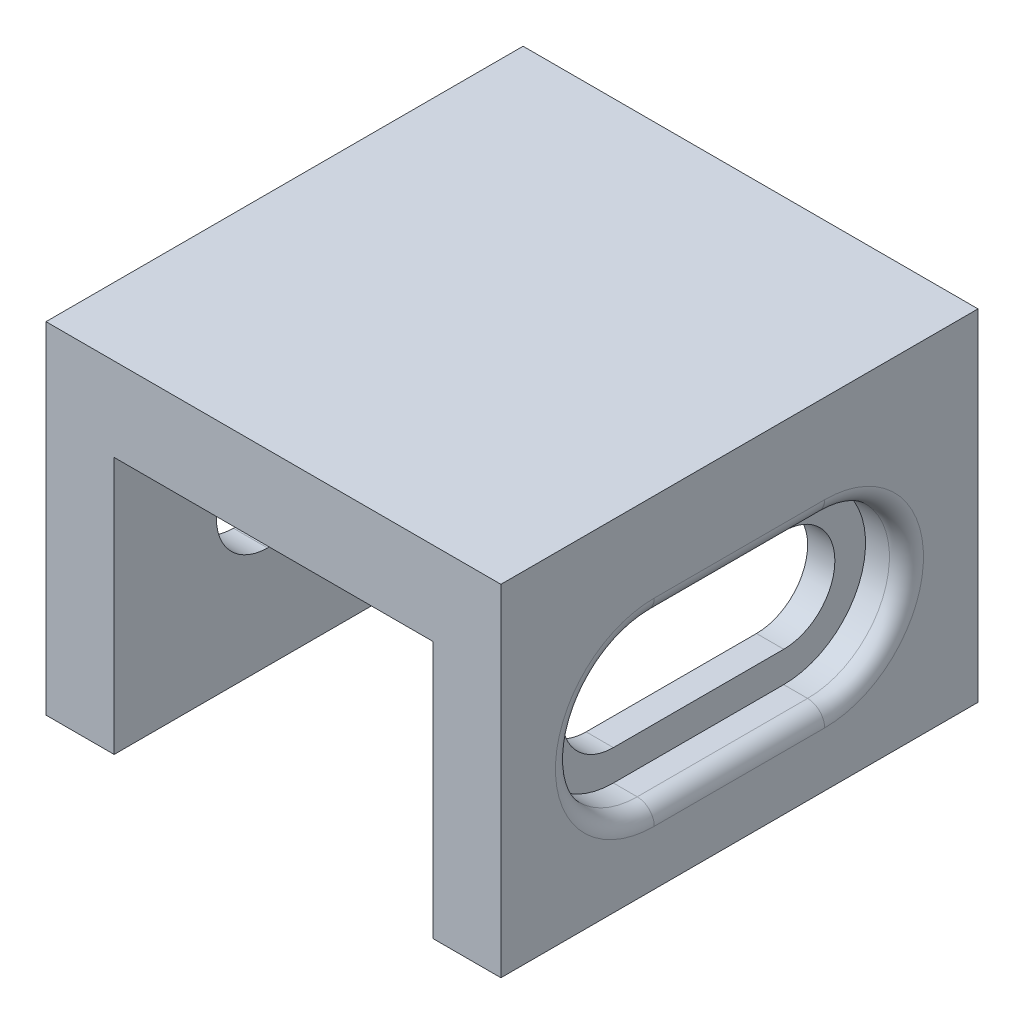
ISO-10303-21;
HEADER;
FILE_DESCRIPTION(('STEP AP214'),'2;1');
FILE_NAME('part.step','',(''),(''),'','','');
FILE_SCHEMA(('AUTOMOTIVE_DESIGN { 1 0 10303 214 1 1 1 1 }'));
ENDSEC;
DATA;
#1=APPLICATION_CONTEXT('core data for automotive mechanical design processes');
#2=APPLICATION_PROTOCOL_DEFINITION('international standard','automotive_design',2000,#1);
#3=PRODUCT_CONTEXT('',#1,'mechanical');
#4=PRODUCT('Part','Part','',(#3));
#5=PRODUCT_RELATED_PRODUCT_CATEGORY('part','',(#4));
#6=PRODUCT_DEFINITION_FORMATION('','',#4);
#7=PRODUCT_DEFINITION_CONTEXT('part definition',#1,'design');
#8=PRODUCT_DEFINITION('design','',#6,#7);
#9=PRODUCT_DEFINITION_SHAPE('','',#8);
#10=(LENGTH_UNIT() NAMED_UNIT(*) SI_UNIT(.MILLI.,.METRE.));
#11=(NAMED_UNIT(*) PLANE_ANGLE_UNIT() SI_UNIT($,.RADIAN.));
#12=(NAMED_UNIT(*) SI_UNIT($,.STERADIAN.) SOLID_ANGLE_UNIT());
#13=UNCERTAINTY_MEASURE_WITH_UNIT(LENGTH_MEASURE(1.E-05),#10,'distance_accuracy_value','');
#14=(GEOMETRIC_REPRESENTATION_CONTEXT(3) GLOBAL_UNCERTAINTY_ASSIGNED_CONTEXT((#13)) GLOBAL_UNIT_ASSIGNED_CONTEXT((#10,
#11,#12)) REPRESENTATION_CONTEXT('',''));
#15=CARTESIAN_POINT('',(0.,0.,0.));
#16=DIRECTION('',(0.,0.,1.));
#17=DIRECTION('',(1.,0.,0.));
#18=AXIS2_PLACEMENT_3D('',#15,#16,#17);
#19=CARTESIAN_POINT('',(27.5,9.,-19.));
#20=DIRECTION('',(-1.,0.,0.));
#21=DIRECTION('',(0.,0.,1.));
#22=AXIS2_PLACEMENT_3D('',#19,#20,#21);
#23=CYLINDRICAL_SURFACE('',#22,2.99999999999999);
#24=CARTESIAN_POINT('',(4.,9.,-19.));
#25=DIRECTION('',(1.,0.,0.));
#26=DIRECTION('',(0.,0.,-1.));
#27=AXIS2_PLACEMENT_3D('',#24,#25,#26);
#28=CIRCLE('',#27,2.99999999999999);
#29=CARTESIAN_POINT('',(4.,12.,-19.));
#30=VERTEX_POINT('',#29);
#31=CARTESIAN_POINT('',(4.,6.00000000000001,-19.));
#32=VERTEX_POINT('',#31);
#33=EDGE_CURVE('E287',#30,#32,#28,.F.);
#34=ORIENTED_EDGE('',*,*,#33,.F.);
#35=DIRECTION('',(-1.,0.,0.));
#36=VECTOR('',#35,1.);
#37=CARTESIAN_POINT('',(27.5,12.,-19.));
#38=LINE('',#37,#36);
#39=CARTESIAN_POINT('',(2.,12.,-19.));
#40=VERTEX_POINT('',#39);
#41=EDGE_CURVE('E378',#30,#40,#38,.T.);
#42=ORIENTED_EDGE('',*,*,#41,.T.);
#43=CARTESIAN_POINT('',(2.,9.,-19.));
#44=DIRECTION('',(-1.,0.,0.));
#45=DIRECTION('',(0.,0.,1.));
#46=AXIS2_PLACEMENT_3D('',#43,#44,#45);
#47=CIRCLE('',#46,2.99999999999999);
#48=CARTESIAN_POINT('',(2.,6.00000000000001,-19.));
#49=VERTEX_POINT('',#48);
#50=EDGE_CURVE('E368',#49,#40,#47,.F.);
#51=ORIENTED_EDGE('',*,*,#50,.F.);
#52=DIRECTION('',(-1.,0.,0.));
#53=VECTOR('',#52,1.);
#54=CARTESIAN_POINT('',(27.5,6.00000000000001,-19.));
#55=LINE('',#54,#53);
#56=EDGE_CURVE('E372',#32,#49,#55,.T.);
#57=ORIENTED_EDGE('',*,*,#56,.F.);
#58=EDGE_LOOP('',(#34,#42,#51,#57));
#59=FACE_BOUND('',#58,.T.);
#60=ADVANCED_FACE('F44',(#59),#23,.F.);
#61=CARTESIAN_POINT('',(22.7,9.,-19.));
#62=DIRECTION('',(-1.,0.,0.));
#63=DIRECTION('',(0.,0.,1.));
#64=AXIS2_PLACEMENT_3D('',#61,#62,#63);
#65=CIRCLE('',#64,2.99999999999999);
#66=CARTESIAN_POINT('',(22.7,6.00000000000001,-19.));
#67=VERTEX_POINT('',#66);
#68=CARTESIAN_POINT('',(22.7,12.,-19.));
#69=VERTEX_POINT('',#68);
#70=EDGE_CURVE('E275',#67,#69,#65,.F.);
#71=ORIENTED_EDGE('',*,*,#70,.F.);
#72=CARTESIAN_POINT('',(24.3,6.00000000000001,-19.));
#73=VERTEX_POINT('',#72);
#74=EDGE_CURVE('E389',#73,#67,#55,.T.);
#75=ORIENTED_EDGE('',*,*,#74,.F.);
#76=CARTESIAN_POINT('',(24.3,9.,-19.));
#77=DIRECTION('',(1.,0.,0.));
#78=DIRECTION('',(0.,0.,-1.));
#79=AXIS2_PLACEMENT_3D('',#76,#77,#78);
#80=CIRCLE('',#79,2.99999999999999);
#81=CARTESIAN_POINT('',(24.3,12.,-19.));
#82=VERTEX_POINT('',#81);
#83=EDGE_CURVE('E325',#82,#73,#80,.F.);
#84=ORIENTED_EDGE('',*,*,#83,.F.);
#85=EDGE_CURVE('E373',#82,#69,#38,.T.);
#86=ORIENTED_EDGE('',*,*,#85,.T.);
#87=EDGE_LOOP('',(#71,#75,#84,#86));
#88=FACE_BOUND('',#87,.T.);
#89=ADVANCED_FACE('F556',(#88),#23,.F.);
#90=CARTESIAN_POINT('',(27.5,12.,-19.));
#91=DIRECTION('',(0.,1.,0.));
#92=DIRECTION('',(0.,0.,1.));
#93=AXIS2_PLACEMENT_3D('',#90,#91,#92);
#94=PLANE('',#93);
#95=DIRECTION('',(0.,0.,-1.));
#96=VECTOR('',#95,1.);
#97=CARTESIAN_POINT('',(4.,12.,-19.));
#98=LINE('',#97,#96);
#99=CARTESIAN_POINT('',(4.,12.,-9.));
#100=VERTEX_POINT('',#99);
#101=EDGE_CURVE('E284',#100,#30,#98,.T.);
#102=ORIENTED_EDGE('',*,*,#101,.F.);
#103=DIRECTION('',(-1.,0.,0.));
#104=VECTOR('',#103,1.);
#105=CARTESIAN_POINT('',(27.5,12.,-9.));
#106=LINE('',#105,#104);
#107=CARTESIAN_POINT('',(2.,12.,-9.));
#108=VERTEX_POINT('',#107);
#109=EDGE_CURVE('E383',#100,#108,#106,.T.);
#110=ORIENTED_EDGE('',*,*,#109,.T.);
#111=DIRECTION('',(0.,0.,1.));
#112=VECTOR('',#111,1.);
#113=CARTESIAN_POINT('',(2.,12.,-19.));
#114=LINE('',#113,#112);
#115=EDGE_CURVE('E364',#40,#108,#114,.T.);
#116=ORIENTED_EDGE('',*,*,#115,.F.);
#117=ORIENTED_EDGE('',*,*,#41,.F.);
#118=EDGE_LOOP('',(#102,#110,#116,#117));
#119=FACE_BOUND('',#118,.T.);
#120=ADVANCED_FACE('F563',(#119),#94,.F.);
#121=DIRECTION('',(0.,0.,1.));
#122=VECTOR('',#121,1.);
#123=CARTESIAN_POINT('',(22.7,12.,-19.));
#124=LINE('',#123,#122);
#125=CARTESIAN_POINT('',(22.7,12.,-9.));
#126=VERTEX_POINT('',#125);
#127=EDGE_CURVE('E272',#69,#126,#124,.T.);
#128=ORIENTED_EDGE('',*,*,#127,.F.);
#129=ORIENTED_EDGE('',*,*,#85,.F.);
#130=DIRECTION('',(0.,0.,-1.));
#131=VECTOR('',#130,1.);
#132=CARTESIAN_POINT('',(24.3,12.,-19.));
#133=LINE('',#132,#131);
#134=CARTESIAN_POINT('',(24.3,12.,-9.));
#135=VERTEX_POINT('',#134);
#136=EDGE_CURVE('E322',#135,#82,#133,.T.);
#137=ORIENTED_EDGE('',*,*,#136,.F.);
#138=EDGE_CURVE('E379',#135,#126,#106,.T.);
#139=ORIENTED_EDGE('',*,*,#138,.T.);
#140=EDGE_LOOP('',(#128,#129,#137,#139));
#141=FACE_BOUND('',#140,.T.);
#142=ADVANCED_FACE('F703',(#141),#94,.F.);
#143=CARTESIAN_POINT('',(27.5,9.00000000000001,-9.));
#144=DIRECTION('',(-1.,0.,0.));
#145=DIRECTION('',(0.,0.,1.));
#146=AXIS2_PLACEMENT_3D('',#143,#144,#145);
#147=CYLINDRICAL_SURFACE('',#146,2.99999999999999);
#148=CARTESIAN_POINT('',(4.,9.00000000000001,-9.));
#149=DIRECTION('',(1.,0.,0.));
#150=DIRECTION('',(0.,0.,-1.));
#151=AXIS2_PLACEMENT_3D('',#148,#149,#150);
#152=CIRCLE('',#151,2.99999999999999);
#153=CARTESIAN_POINT('',(4.,6.00000000000001,-9.));
#154=VERTEX_POINT('',#153);
#155=EDGE_CURVE('E281',#154,#100,#152,.F.);
#156=ORIENTED_EDGE('',*,*,#155,.F.);
#157=DIRECTION('',(-1.,0.,0.));
#158=VECTOR('',#157,1.);
#159=CARTESIAN_POINT('',(27.5,6.00000000000001,-9.));
#160=LINE('',#159,#158);
#161=CARTESIAN_POINT('',(2.,6.00000000000001,-9.));
#162=VERTEX_POINT('',#161);
#163=EDGE_CURVE('E388',#154,#162,#160,.T.);
#164=ORIENTED_EDGE('',*,*,#163,.T.);
#165=CARTESIAN_POINT('',(2.,9.00000000000001,-9.));
#166=DIRECTION('',(-1.,0.,0.));
#167=DIRECTION('',(0.,0.,1.));
#168=AXIS2_PLACEMENT_3D('',#165,#166,#167);
#169=CIRCLE('',#168,2.99999999999999);
#170=EDGE_CURVE('E349',#108,#162,#169,.F.);
#171=ORIENTED_EDGE('',*,*,#170,.F.);
#172=ORIENTED_EDGE('',*,*,#109,.F.);
#173=EDGE_LOOP('',(#156,#164,#171,#172));
#174=FACE_BOUND('',#173,.T.);
#175=ADVANCED_FACE('F695',(#174),#147,.F.);
#176=CARTESIAN_POINT('',(22.7,9.00000000000001,-9.));
#177=DIRECTION('',(-1.,0.,0.));
#178=DIRECTION('',(0.,0.,1.));
#179=AXIS2_PLACEMENT_3D('',#176,#177,#178);
#180=CIRCLE('',#179,2.99999999999999);
#181=CARTESIAN_POINT('',(22.7,6.00000000000001,-9.));
#182=VERTEX_POINT('',#181);
#183=EDGE_CURVE('E264',#126,#182,#180,.F.);
#184=ORIENTED_EDGE('',*,*,#183,.F.);
#185=ORIENTED_EDGE('',*,*,#138,.F.);
#186=CARTESIAN_POINT('',(24.3,9.00000000000001,-9.));
#187=DIRECTION('',(1.,0.,0.));
#188=DIRECTION('',(0.,0.,-1.));
#189=AXIS2_PLACEMENT_3D('',#186,#187,#188);
#190=CIRCLE('',#189,2.99999999999999);
#191=CARTESIAN_POINT('',(24.3,6.00000000000001,-9.));
#192=VERTEX_POINT('',#191);
#193=EDGE_CURVE('E311',#192,#135,#190,.F.);
#194=ORIENTED_EDGE('',*,*,#193,.F.);
#195=EDGE_CURVE('E384',#192,#182,#160,.T.);
#196=ORIENTED_EDGE('',*,*,#195,.T.);
#197=EDGE_LOOP('',(#184,#185,#194,#196));
#198=FACE_BOUND('',#197,.T.);
#199=ADVANCED_FACE('F687',(#198),#147,.F.);
#200=CARTESIAN_POINT('',(27.5,6.00000000000001,-19.));
#201=DIRECTION('',(0.,-1.,0.));
#202=DIRECTION('',(0.,0.,-1.));
#203=AXIS2_PLACEMENT_3D('',#200,#201,#202);
#204=PLANE('',#203);
#205=DIRECTION('',(0.,0.,1.));
#206=VECTOR('',#205,1.);
#207=CARTESIAN_POINT('',(4.,6.00000000000001,-19.));
#208=LINE('',#207,#206);
#209=EDGE_CURVE('E278',#32,#154,#208,.T.);
#210=ORIENTED_EDGE('',*,*,#209,.F.);
#211=ORIENTED_EDGE('',*,*,#56,.T.);
#212=DIRECTION('',(0.,0.,-1.));
#213=VECTOR('',#212,1.);
#214=CARTESIAN_POINT('',(2.,6.00000000000001,-19.));
#215=LINE('',#214,#213);
#216=EDGE_CURVE('E435',#162,#49,#215,.T.);
#217=ORIENTED_EDGE('',*,*,#216,.F.);
#218=ORIENTED_EDGE('',*,*,#163,.F.);
#219=EDGE_LOOP('',(#210,#211,#217,#218));
#220=FACE_BOUND('',#219,.T.);
#221=ADVANCED_FACE('F568',(#220),#204,.F.);
#222=DIRECTION('',(0.,0.,-1.));
#223=VECTOR('',#222,1.);
#224=CARTESIAN_POINT('',(22.7,6.00000000000001,-19.));
#225=LINE('',#224,#223);
#226=EDGE_CURVE('E259',#182,#67,#225,.T.);
#227=ORIENTED_EDGE('',*,*,#226,.F.);
#228=ORIENTED_EDGE('',*,*,#195,.F.);
#229=DIRECTION('',(0.,0.,1.));
#230=VECTOR('',#229,1.);
#231=CARTESIAN_POINT('',(24.3,6.00000000000001,-19.));
#232=LINE('',#231,#230);
#233=EDGE_CURVE('E439',#73,#192,#232,.T.);
#234=ORIENTED_EDGE('',*,*,#233,.F.);
#235=ORIENTED_EDGE('',*,*,#74,.T.);
#236=EDGE_LOOP('',(#227,#228,#234,#235));
#237=FACE_BOUND('',#236,.T.);
#238=ADVANCED_FACE('F589',(#237),#204,.F.);
#239=CARTESIAN_POINT('',(0.,20.,0.));
#240=DIRECTION('',(0.,0.,-1.));
#241=DIRECTION('',(-1.,0.,0.));
#242=AXIS2_PLACEMENT_3D('',#239,#240,#241);
#243=PLANE('',#242);
#244=DIRECTION('',(0.,-1.,0.));
#245=VECTOR('',#244,1.);
#246=CARTESIAN_POINT('',(4.,15.1,0.));
#247=LINE('',#246,#245);
#248=CARTESIAN_POINT('',(4.,15.1,0.));
#249=VERTEX_POINT('',#248);
#250=CARTESIAN_POINT('',(4.,0.,0.));
#251=VERTEX_POINT('',#250);
#252=EDGE_CURVE('E247',#249,#251,#247,.T.);
#253=ORIENTED_EDGE('',*,*,#252,.F.);
#254=DIRECTION('',(1.,0.,0.));
#255=VECTOR('',#254,1.);
#256=CARTESIAN_POINT('',(4.,15.1,0.));
#257=LINE('',#256,#255);
#258=CARTESIAN_POINT('',(22.7,15.1,0.));
#259=VERTEX_POINT('',#258);
#260=EDGE_CURVE('E232',#249,#259,#257,.T.);
#261=ORIENTED_EDGE('',*,*,#260,.T.);
#262=DIRECTION('',(0.,-1.,0.));
#263=VECTOR('',#262,1.);
#264=CARTESIAN_POINT('',(22.7,15.1,0.));
#265=LINE('',#264,#263);
#266=CARTESIAN_POINT('',(22.7,0.,0.));
#267=VERTEX_POINT('',#266);
#268=EDGE_CURVE('E260',#259,#267,#265,.T.);
#269=ORIENTED_EDGE('',*,*,#268,.T.);
#270=DIRECTION('',(1.,0.,0.));
#271=VECTOR('',#270,1.);
#272=CARTESIAN_POINT('',(0.,0.,0.));
#273=LINE('',#272,#271);
#274=CARTESIAN_POINT('',(26.7,0.,0.));
#275=VERTEX_POINT('',#274);
#276=EDGE_CURVE('E411',#267,#275,#273,.T.);
#277=ORIENTED_EDGE('',*,*,#276,.T.);
#278=DIRECTION('',(0.,-1.,0.));
#279=VECTOR('',#278,1.);
#280=CARTESIAN_POINT('',(26.7,20.,0.));
#281=LINE('',#280,#279);
#282=CARTESIAN_POINT('',(26.7,20.,0.));
#283=VERTEX_POINT('',#282);
#284=EDGE_CURVE('E428',#283,#275,#281,.T.);
#285=ORIENTED_EDGE('',*,*,#284,.F.);
#286=DIRECTION('',(1.,0.,0.));
#287=VECTOR('',#286,1.);
#288=CARTESIAN_POINT('',(0.,20.,0.));
#289=LINE('',#288,#287);
#290=CARTESIAN_POINT('',(0.,20.,0.));
#291=VERTEX_POINT('',#290);
#292=EDGE_CURVE('E397',#291,#283,#289,.T.);
#293=ORIENTED_EDGE('',*,*,#292,.F.);
#294=DIRECTION('',(0.,-1.,0.));
#295=VECTOR('',#294,1.);
#296=CARTESIAN_POINT('',(0.,20.,0.));
#297=LINE('',#296,#295);
#298=CARTESIAN_POINT('',(0.,0.,0.));
#299=VERTEX_POINT('',#298);
#300=EDGE_CURVE('E432',#291,#299,#297,.T.);
#301=ORIENTED_EDGE('',*,*,#300,.T.);
#302=EDGE_CURVE('E257',#299,#251,#273,.T.);
#303=ORIENTED_EDGE('',*,*,#302,.T.);
#304=EDGE_LOOP('',(#253,#261,#269,#277,#285,#293,#301,#303));
#305=FACE_BOUND('',#304,.T.);
#306=ADVANCED_FACE('F255',(#305),#243,.F.);
#307=CARTESIAN_POINT('',(0.,20.,-28.));
#308=DIRECTION('',(0.,0.,1.));
#309=DIRECTION('',(1.,0.,0.));
#310=AXIS2_PLACEMENT_3D('',#307,#308,#309);
#311=PLANE('',#310);
#312=DIRECTION('',(0.,-1.,0.));
#313=VECTOR('',#312,1.);
#314=CARTESIAN_POINT('',(4.,15.1,-28.));
#315=LINE('',#314,#313);
#316=CARTESIAN_POINT('',(4.,15.1,-28.));
#317=VERTEX_POINT('',#316);
#318=CARTESIAN_POINT('',(4.,0.,-28.));
#319=VERTEX_POINT('',#318);
#320=EDGE_CURVE('E250',#317,#319,#315,.T.);
#321=ORIENTED_EDGE('',*,*,#320,.T.);
#322=DIRECTION('',(-1.,0.,0.));
#323=VECTOR('',#322,1.);
#324=CARTESIAN_POINT('',(0.,0.,-28.));
#325=LINE('',#324,#323);
#326=CARTESIAN_POINT('',(0.,0.,-28.));
#327=VERTEX_POINT('',#326);
#328=EDGE_CURVE('E417',#319,#327,#325,.T.);
#329=ORIENTED_EDGE('',*,*,#328,.T.);
#330=DIRECTION('',(0.,-1.,0.));
#331=VECTOR('',#330,1.);
#332=CARTESIAN_POINT('',(0.,20.,-28.));
#333=LINE('',#332,#331);
#334=CARTESIAN_POINT('',(0.,20.,-28.));
#335=VERTEX_POINT('',#334);
#336=EDGE_CURVE('E407',#335,#327,#333,.T.);
#337=ORIENTED_EDGE('',*,*,#336,.F.);
#338=DIRECTION('',(-1.,0.,0.));
#339=VECTOR('',#338,1.);
#340=CARTESIAN_POINT('',(0.,20.,-28.));
#341=LINE('',#340,#339);
#342=CARTESIAN_POINT('',(26.7,20.,-28.));
#343=VERTEX_POINT('',#342);
#344=EDGE_CURVE('E404',#343,#335,#341,.T.);
#345=ORIENTED_EDGE('',*,*,#344,.F.);
#346=DIRECTION('',(0.,-1.,0.));
#347=VECTOR('',#346,1.);
#348=CARTESIAN_POINT('',(26.7,20.,-28.));
#349=LINE('',#348,#347);
#350=CARTESIAN_POINT('',(26.7,0.,-28.));
#351=VERTEX_POINT('',#350);
#352=EDGE_CURVE('E424',#343,#351,#349,.T.);
#353=ORIENTED_EDGE('',*,*,#352,.T.);
#354=CARTESIAN_POINT('',(22.7,0.,-28.));
#355=VERTEX_POINT('',#354);
#356=EDGE_CURVE('E398',#351,#355,#325,.T.);
#357=ORIENTED_EDGE('',*,*,#356,.T.);
#358=DIRECTION('',(0.,-1.,0.));
#359=VECTOR('',#358,1.);
#360=CARTESIAN_POINT('',(22.7,15.1,-28.));
#361=LINE('',#360,#359);
#362=CARTESIAN_POINT('',(22.7,15.1,-28.));
#363=VERTEX_POINT('',#362);
#364=EDGE_CURVE('E266',#363,#355,#361,.T.);
#365=ORIENTED_EDGE('',*,*,#364,.F.);
#366=DIRECTION('',(-1.,0.,0.));
#367=VECTOR('',#366,1.);
#368=CARTESIAN_POINT('',(4.,15.1,-28.));
#369=LINE('',#368,#367);
#370=EDGE_CURVE('E886',#363,#317,#369,.T.);
#371=ORIENTED_EDGE('',*,*,#370,.T.);
#372=EDGE_LOOP('',(#321,#329,#337,#345,#353,#357,#365,#371));
#373=FACE_BOUND('',#372,.T.);
#374=ADVANCED_FACE('F579',(#373),#311,.F.);
#375=CARTESIAN_POINT('',(0.,0.,0.));
#376=DIRECTION('',(0.,-1.,0.));
#377=DIRECTION('',(0.,0.,-1.));
#378=AXIS2_PLACEMENT_3D('',#375,#376,#377);
#379=PLANE('',#378);
#380=ORIENTED_EDGE('',*,*,#328,.F.);
#381=DIRECTION('',(0.,0.,1.));
#382=VECTOR('',#381,1.);
#383=CARTESIAN_POINT('',(4.,0.,-28.));
#384=LINE('',#383,#382);
#385=EDGE_CURVE('E503',#319,#251,#384,.T.);
#386=ORIENTED_EDGE('',*,*,#385,.T.);
#387=ORIENTED_EDGE('',*,*,#302,.F.);
#388=DIRECTION('',(0.,0.,1.));
#389=VECTOR('',#388,1.);
#390=CARTESIAN_POINT('',(0.,0.,0.));
#391=LINE('',#390,#389);
#392=EDGE_CURVE('E377',#327,#299,#391,.T.);
#393=ORIENTED_EDGE('',*,*,#392,.F.);
#394=EDGE_LOOP('',(#380,#386,#387,#393));
#395=FACE_BOUND('',#394,.T.);
#396=ADVANCED_FACE('F575',(#395),#379,.T.);
#397=ORIENTED_EDGE('',*,*,#276,.F.);
#398=DIRECTION('',(0.,0.,-1.));
#399=VECTOR('',#398,1.);
#400=CARTESIAN_POINT('',(22.7,0.,-28.));
#401=LINE('',#400,#399);
#402=EDGE_CURVE('E252',#267,#355,#401,.T.);
#403=ORIENTED_EDGE('',*,*,#402,.T.);
#404=ORIENTED_EDGE('',*,*,#356,.F.);
#405=DIRECTION('',(0.,0.,-1.));
#406=VECTOR('',#405,1.);
#407=CARTESIAN_POINT('',(26.7,0.,0.));
#408=LINE('',#407,#406);
#409=EDGE_CURVE('E414',#275,#351,#408,.T.);
#410=ORIENTED_EDGE('',*,*,#409,.F.);
#411=EDGE_LOOP('',(#397,#403,#404,#410));
#412=FACE_BOUND('',#411,.T.);
#413=ADVANCED_FACE('F578',(#412),#379,.T.);
#414=CARTESIAN_POINT('',(0.,20.,0.));
#415=DIRECTION('',(1.,0.,0.));
#416=DIRECTION('',(0.,0.,-1.));
#417=AXIS2_PLACEMENT_3D('',#414,#415,#416);
#418=PLANE('',#417);
#419=DIRECTION('',(0.,0.,1.));
#420=VECTOR('',#419,1.);
#421=CARTESIAN_POINT('',(0.,3.20000000000001,0.));
#422=LINE('',#421,#420);
#423=CARTESIAN_POINT('',(0.,3.20000000000001,-9.));
#424=VERTEX_POINT('',#423);
#425=CARTESIAN_POINT('',(0.,3.20000000000001,-19.));
#426=VERTEX_POINT('',#425);
#427=EDGE_CURVE('E446',#424,#426,#422,.F.);
#428=ORIENTED_EDGE('',*,*,#427,.T.);
#429=CARTESIAN_POINT('',(0.,9.,-19.));
#430=DIRECTION('',(1.,0.,0.));
#431=DIRECTION('',(0.,0.,-1.));
#432=AXIS2_PLACEMENT_3D('',#429,#430,#431);
#433=CIRCLE('',#432,5.79999999999999);
#434=CARTESIAN_POINT('',(0.,14.8,-19.));
#435=VERTEX_POINT('',#434);
#436=EDGE_CURVE('E455',#426,#435,#433,.T.);
#437=ORIENTED_EDGE('',*,*,#436,.T.);
#438=DIRECTION('',(0.,0.,-1.));
#439=VECTOR('',#438,1.);
#440=CARTESIAN_POINT('',(0.,14.8,0.));
#441=LINE('',#440,#439);
#442=CARTESIAN_POINT('',(0.,14.8,-9.));
#443=VERTEX_POINT('',#442);
#444=EDGE_CURVE('E452',#435,#443,#441,.F.);
#445=ORIENTED_EDGE('',*,*,#444,.T.);
#446=CARTESIAN_POINT('',(0.,9.00000000000001,-9.));
#447=DIRECTION('',(1.,0.,0.));
#448=DIRECTION('',(0.,0.,-1.));
#449=AXIS2_PLACEMENT_3D('',#446,#447,#448);
#450=CIRCLE('',#449,5.79999999999999);
#451=EDGE_CURVE('E449',#443,#424,#450,.T.);
#452=ORIENTED_EDGE('',*,*,#451,.T.);
#453=EDGE_LOOP('',(#428,#437,#445,#452));
#454=FACE_BOUND('',#453,.T.);
#455=ORIENTED_EDGE('',*,*,#392,.T.);
#456=ORIENTED_EDGE('',*,*,#300,.F.);
#457=DIRECTION('',(0.,0.,1.));
#458=VECTOR('',#457,1.);
#459=CARTESIAN_POINT('',(0.,20.,0.));
#460=LINE('',#459,#458);
#461=EDGE_CURVE('E393',#335,#291,#460,.T.);
#462=ORIENTED_EDGE('',*,*,#461,.F.);
#463=ORIENTED_EDGE('',*,*,#336,.T.);
#464=EDGE_LOOP('',(#455,#456,#462,#463));
#465=FACE_BOUND('',#464,.T.);
#466=ADVANCED_FACE('F586',(#454,#465),#418,.F.);
#467=CARTESIAN_POINT('',(26.7,20.,0.));
#468=DIRECTION('',(-1.,0.,0.));
#469=DIRECTION('',(0.,0.,1.));
#470=AXIS2_PLACEMENT_3D('',#467,#468,#469);
#471=PLANE('',#470);
#472=DIRECTION('',(0.,0.,-1.));
#473=VECTOR('',#472,1.);
#474=CARTESIAN_POINT('',(26.7,3.2,0.));
#475=LINE('',#474,#473);
#476=CARTESIAN_POINT('',(26.7,3.2,-19.));
#477=VERTEX_POINT('',#476);
#478=CARTESIAN_POINT('',(26.7,3.2,-9.));
#479=VERTEX_POINT('',#478);
#480=EDGE_CURVE('E469',#477,#479,#475,.F.);
#481=ORIENTED_EDGE('',*,*,#480,.T.);
#482=CARTESIAN_POINT('',(26.7,9.00000000000001,-9.));
#483=DIRECTION('',(-1.,0.,0.));
#484=DIRECTION('',(0.,0.,1.));
#485=AXIS2_PLACEMENT_3D('',#482,#483,#484);
#486=CIRCLE('',#485,5.80000000000001);
#487=CARTESIAN_POINT('',(26.7,14.8,-9.));
#488=VERTEX_POINT('',#487);
#489=EDGE_CURVE('E478',#479,#488,#486,.T.);
#490=ORIENTED_EDGE('',*,*,#489,.T.);
#491=DIRECTION('',(0.,0.,1.));
#492=VECTOR('',#491,1.);
#493=CARTESIAN_POINT('',(26.7,14.8,0.));
#494=LINE('',#493,#492);
#495=CARTESIAN_POINT('',(26.7,14.8,-19.));
#496=VERTEX_POINT('',#495);
#497=EDGE_CURVE('E475',#488,#496,#494,.F.);
#498=ORIENTED_EDGE('',*,*,#497,.T.);
#499=CARTESIAN_POINT('',(26.7,9.,-19.));
#500=DIRECTION('',(-1.,0.,0.));
#501=DIRECTION('',(0.,0.,1.));
#502=AXIS2_PLACEMENT_3D('',#499,#500,#501);
#503=CIRCLE('',#502,5.80000000000001);
#504=EDGE_CURVE('E472',#496,#477,#503,.T.);
#505=ORIENTED_EDGE('',*,*,#504,.T.);
#506=EDGE_LOOP('',(#481,#490,#498,#505));
#507=FACE_BOUND('',#506,.T.);
#508=ORIENTED_EDGE('',*,*,#409,.T.);
#509=ORIENTED_EDGE('',*,*,#352,.F.);
#510=DIRECTION('',(0.,0.,-1.));
#511=VECTOR('',#510,1.);
#512=CARTESIAN_POINT('',(26.7,20.,0.));
#513=LINE('',#512,#511);
#514=EDGE_CURVE('E401',#283,#343,#513,.T.);
#515=ORIENTED_EDGE('',*,*,#514,.F.);
#516=ORIENTED_EDGE('',*,*,#284,.T.);
#517=EDGE_LOOP('',(#508,#509,#515,#516));
#518=FACE_BOUND('',#517,.T.);
#519=ADVANCED_FACE('F526',(#507,#518),#471,.F.);
#520=CARTESIAN_POINT('',(0.,20.,0.));
#521=DIRECTION('',(0.,-1.,0.));
#522=DIRECTION('',(0.,0.,-1.));
#523=AXIS2_PLACEMENT_3D('',#520,#521,#522);
#524=PLANE('',#523);
#525=ORIENTED_EDGE('',*,*,#461,.T.);
#526=ORIENTED_EDGE('',*,*,#292,.T.);
#527=ORIENTED_EDGE('',*,*,#514,.T.);
#528=ORIENTED_EDGE('',*,*,#344,.T.);
#529=EDGE_LOOP('',(#525,#526,#527,#528));
#530=FACE_BOUND('',#529,.T.);
#531=ADVANCED_FACE('F570',(#530),#524,.F.);
#532=CARTESIAN_POINT('',(2.,9.,-19.));
#533=DIRECTION('',(-1.,0.,0.));
#534=DIRECTION('',(0.,0.,1.));
#535=AXIS2_PLACEMENT_3D('',#532,#533,#534);
#536=PLANE('',#535);
#537=CARTESIAN_POINT('',(2.,9.,-19.));
#538=DIRECTION('',(-1.,0.,0.));
#539=DIRECTION('',(0.,0.,1.));
#540=AXIS2_PLACEMENT_3D('',#537,#538,#539);
#541=CIRCLE('',#540,4.79999999999999);
#542=CARTESIAN_POINT('',(2.,13.8,-19.));
#543=VERTEX_POINT('',#542);
#544=CARTESIAN_POINT('',(2.,4.20000000000001,-19.));
#545=VERTEX_POINT('',#544);
#546=EDGE_CURVE('E328',#543,#545,#541,.T.);
#547=ORIENTED_EDGE('',*,*,#546,.T.);
#548=DIRECTION('',(0.,0.,1.));
#549=VECTOR('',#548,1.);
#550=CARTESIAN_POINT('',(2.,4.20000000000001,-19.));
#551=LINE('',#550,#549);
#552=CARTESIAN_POINT('',(2.,4.20000000000002,-9.));
#553=VERTEX_POINT('',#552);
#554=EDGE_CURVE('E332',#545,#553,#551,.T.);
#555=ORIENTED_EDGE('',*,*,#554,.T.);
#556=CARTESIAN_POINT('',(2.,9.00000000000001,-9.));
#557=DIRECTION('',(-1.,0.,0.));
#558=DIRECTION('',(0.,0.,1.));
#559=AXIS2_PLACEMENT_3D('',#556,#557,#558);
#560=CIRCLE('',#559,4.79999999999999);
#561=CARTESIAN_POINT('',(2.,13.8,-9.));
#562=VERTEX_POINT('',#561);
#563=EDGE_CURVE('E336',#553,#562,#560,.T.);
#564=ORIENTED_EDGE('',*,*,#563,.T.);
#565=DIRECTION('',(0.,0.,-1.));
#566=VECTOR('',#565,1.);
#567=CARTESIAN_POINT('',(2.,13.8,-19.));
#568=LINE('',#567,#566);
#569=EDGE_CURVE('E340',#562,#543,#568,.T.);
#570=ORIENTED_EDGE('',*,*,#569,.T.);
#571=EDGE_LOOP('',(#547,#555,#564,#570));
#572=FACE_BOUND('',#571,.T.);
#573=ORIENTED_EDGE('',*,*,#50,.T.);
#574=ORIENTED_EDGE('',*,*,#115,.T.);
#575=ORIENTED_EDGE('',*,*,#170,.T.);
#576=ORIENTED_EDGE('',*,*,#216,.T.);
#577=EDGE_LOOP('',(#573,#574,#575,#576));
#578=FACE_BOUND('',#577,.T.);
#579=ADVANCED_FACE('F573',(#572,#578),#536,.T.);
#580=CARTESIAN_POINT('',(2.,9.,-19.));
#581=DIRECTION('',(-1.,0.,0.));
#582=DIRECTION('',(0.,0.,1.));
#583=AXIS2_PLACEMENT_3D('',#580,#581,#582);
#584=CYLINDRICAL_SURFACE('',#583,4.79999999999999);
#585=DIRECTION('',(-1.,0.,0.));
#586=VECTOR('',#585,1.);
#587=CARTESIAN_POINT('',(2.,13.8,-19.));
#588=LINE('',#587,#586);
#589=CARTESIAN_POINT('',(1.,13.8,-19.));
#590=VERTEX_POINT('',#589);
#591=EDGE_CURVE('E345',#543,#590,#588,.T.);
#592=ORIENTED_EDGE('',*,*,#591,.T.);
#593=CARTESIAN_POINT('',(1.,9.,-19.));
#594=DIRECTION('',(1.,0.,0.));
#595=DIRECTION('',(0.,0.,-1.));
#596=AXIS2_PLACEMENT_3D('',#593,#594,#595);
#597=CIRCLE('',#596,4.79999999999999);
#598=CARTESIAN_POINT('',(1.,4.20000000000001,-19.));
#599=VERTEX_POINT('',#598);
#600=EDGE_CURVE('E442',#590,#599,#597,.F.);
#601=ORIENTED_EDGE('',*,*,#600,.T.);
#602=DIRECTION('',(-1.,0.,0.));
#603=VECTOR('',#602,1.);
#604=CARTESIAN_POINT('',(2.,4.20000000000001,-19.));
#605=LINE('',#604,#603);
#606=EDGE_CURVE('E344',#545,#599,#605,.T.);
#607=ORIENTED_EDGE('',*,*,#606,.F.);
#608=ORIENTED_EDGE('',*,*,#546,.F.);
#609=EDGE_LOOP('',(#592,#601,#607,#608));
#610=FACE_BOUND('',#609,.T.);
#611=ADVANCED_FACE('F766',(#610),#584,.F.);
#612=CARTESIAN_POINT('',(2.,13.8,-19.));
#613=DIRECTION('',(0.,1.,0.));
#614=DIRECTION('',(0.,0.,1.));
#615=AXIS2_PLACEMENT_3D('',#612,#613,#614);
#616=PLANE('',#615);
#617=DIRECTION('',(-1.,0.,0.));
#618=VECTOR('',#617,1.);
#619=CARTESIAN_POINT('',(2.,13.8,-9.));
#620=LINE('',#619,#618);
#621=CARTESIAN_POINT('',(1.,13.8,-9.));
#622=VERTEX_POINT('',#621);
#623=EDGE_CURVE('E350',#562,#622,#620,.T.);
#624=ORIENTED_EDGE('',*,*,#623,.T.);
#625=DIRECTION('',(0.,0.,-1.));
#626=VECTOR('',#625,1.);
#627=CARTESIAN_POINT('',(1.,13.8,-19.));
#628=LINE('',#627,#626);
#629=EDGE_CURVE('E459',#622,#590,#628,.T.);
#630=ORIENTED_EDGE('',*,*,#629,.T.);
#631=ORIENTED_EDGE('',*,*,#591,.F.);
#632=ORIENTED_EDGE('',*,*,#569,.F.);
#633=EDGE_LOOP('',(#624,#630,#631,#632));
#634=FACE_BOUND('',#633,.T.);
#635=ADVANCED_FACE('F770',(#634),#616,.F.);
#636=CARTESIAN_POINT('',(2.,9.00000000000001,-9.));
#637=DIRECTION('',(-1.,0.,0.));
#638=DIRECTION('',(0.,0.,1.));
#639=AXIS2_PLACEMENT_3D('',#636,#637,#638);
#640=CYLINDRICAL_SURFACE('',#639,4.79999999999999);
#641=DIRECTION('',(-1.,0.,0.));
#642=VECTOR('',#641,1.);
#643=CARTESIAN_POINT('',(2.,4.20000000000002,-9.));
#644=LINE('',#643,#642);
#645=CARTESIAN_POINT('',(1.,4.20000000000002,-9.));
#646=VERTEX_POINT('',#645);
#647=EDGE_CURVE('E354',#553,#646,#644,.T.);
#648=ORIENTED_EDGE('',*,*,#647,.T.);
#649=CARTESIAN_POINT('',(1.,9.00000000000001,-9.));
#650=DIRECTION('',(1.,0.,0.));
#651=DIRECTION('',(0.,0.,-1.));
#652=AXIS2_PLACEMENT_3D('',#649,#650,#651);
#653=CIRCLE('',#652,4.79999999999999);
#654=EDGE_CURVE('E462',#646,#622,#653,.F.);
#655=ORIENTED_EDGE('',*,*,#654,.T.);
#656=ORIENTED_EDGE('',*,*,#623,.F.);
#657=ORIENTED_EDGE('',*,*,#563,.F.);
#658=EDGE_LOOP('',(#648,#655,#656,#657));
#659=FACE_BOUND('',#658,.T.);
#660=ADVANCED_FACE('F780',(#659),#640,.F.);
#661=CARTESIAN_POINT('',(2.,4.20000000000001,-19.));
#662=DIRECTION('',(0.,-1.,0.));
#663=DIRECTION('',(0.,0.,-1.));
#664=AXIS2_PLACEMENT_3D('',#661,#662,#663);
#665=PLANE('',#664);
#666=ORIENTED_EDGE('',*,*,#606,.T.);
#667=DIRECTION('',(0.,0.,1.));
#668=VECTOR('',#667,1.);
#669=CARTESIAN_POINT('',(1.,4.20000000000001,-19.));
#670=LINE('',#669,#668);
#671=EDGE_CURVE('E54',#599,#646,#670,.T.);
#672=ORIENTED_EDGE('',*,*,#671,.T.);
#673=ORIENTED_EDGE('',*,*,#647,.F.);
#674=ORIENTED_EDGE('',*,*,#554,.F.);
#675=EDGE_LOOP('',(#666,#672,#673,#674));
#676=FACE_BOUND('',#675,.T.);
#677=ADVANCED_FACE('F789',(#676),#665,.F.);
#678=CARTESIAN_POINT('',(24.3,9.00000000000001,-9.));
#679=DIRECTION('',(1.,0.,0.));
#680=DIRECTION('',(0.,0.,-1.));
#681=AXIS2_PLACEMENT_3D('',#678,#679,#680);
#682=PLANE('',#681);
#683=CARTESIAN_POINT('',(24.3,9.00000000000001,-9.));
#684=DIRECTION('',(1.,0.,0.));
#685=DIRECTION('',(0.,0.,-1.));
#686=AXIS2_PLACEMENT_3D('',#683,#684,#685);
#687=CIRCLE('',#686,4.80000000000001);
#688=CARTESIAN_POINT('',(24.3,13.8,-9.));
#689=VERTEX_POINT('',#688);
#690=CARTESIAN_POINT('',(24.3,4.2,-9.));
#691=VERTEX_POINT('',#690);
#692=EDGE_CURVE('E290',#689,#691,#687,.T.);
#693=ORIENTED_EDGE('',*,*,#692,.T.);
#694=DIRECTION('',(0.,0.,-1.));
#695=VECTOR('',#694,1.);
#696=CARTESIAN_POINT('',(24.3,4.2,-9.));
#697=LINE('',#696,#695);
#698=CARTESIAN_POINT('',(24.3,4.19999999999999,-19.));
#699=VERTEX_POINT('',#698);
#700=EDGE_CURVE('E294',#691,#699,#697,.T.);
#701=ORIENTED_EDGE('',*,*,#700,.T.);
#702=CARTESIAN_POINT('',(24.3,9.,-19.));
#703=DIRECTION('',(1.,0.,0.));
#704=DIRECTION('',(0.,0.,-1.));
#705=AXIS2_PLACEMENT_3D('',#702,#703,#704);
#706=CIRCLE('',#705,4.80000000000001);
#707=CARTESIAN_POINT('',(24.3,13.8,-19.));
#708=VERTEX_POINT('',#707);
#709=EDGE_CURVE('E298',#699,#708,#706,.T.);
#710=ORIENTED_EDGE('',*,*,#709,.T.);
#711=DIRECTION('',(0.,0.,1.));
#712=VECTOR('',#711,1.);
#713=CARTESIAN_POINT('',(24.3,13.8,-9.));
#714=LINE('',#713,#712);
#715=EDGE_CURVE('E302',#708,#689,#714,.T.);
#716=ORIENTED_EDGE('',*,*,#715,.T.);
#717=EDGE_LOOP('',(#693,#701,#710,#716));
#718=FACE_BOUND('',#717,.T.);
#719=ORIENTED_EDGE('',*,*,#83,.T.);
#720=ORIENTED_EDGE('',*,*,#233,.T.);
#721=ORIENTED_EDGE('',*,*,#193,.T.);
#722=ORIENTED_EDGE('',*,*,#136,.T.);
#723=EDGE_LOOP('',(#719,#720,#721,#722));
#724=FACE_BOUND('',#723,.T.);
#725=ADVANCED_FACE('F541',(#718,#724),#682,.T.);
#726=CARTESIAN_POINT('',(24.3,9.00000000000001,-9.));
#727=DIRECTION('',(1.,0.,0.));
#728=DIRECTION('',(0.,0.,-1.));
#729=AXIS2_PLACEMENT_3D('',#726,#727,#728);
#730=CYLINDRICAL_SURFACE('',#729,4.80000000000001);
#731=DIRECTION('',(1.,0.,0.));
#732=VECTOR('',#731,1.);
#733=CARTESIAN_POINT('',(24.3,13.8,-9.));
#734=LINE('',#733,#732);
#735=CARTESIAN_POINT('',(25.7,13.8,-9.));
#736=VERTEX_POINT('',#735);
#737=EDGE_CURVE('E307',#689,#736,#734,.T.);
#738=ORIENTED_EDGE('',*,*,#737,.T.);
#739=CARTESIAN_POINT('',(25.7,9.00000000000001,-9.));
#740=DIRECTION('',(-1.,0.,0.));
#741=DIRECTION('',(0.,0.,1.));
#742=AXIS2_PLACEMENT_3D('',#739,#740,#741);
#743=CIRCLE('',#742,4.80000000000001);
#744=CARTESIAN_POINT('',(25.7,4.2,-9.));
#745=VERTEX_POINT('',#744);
#746=EDGE_CURVE('E465',#736,#745,#743,.F.);
#747=ORIENTED_EDGE('',*,*,#746,.T.);
#748=DIRECTION('',(1.,0.,0.));
#749=VECTOR('',#748,1.);
#750=CARTESIAN_POINT('',(24.3,4.2,-9.));
#751=LINE('',#750,#749);
#752=EDGE_CURVE('E306',#691,#745,#751,.T.);
#753=ORIENTED_EDGE('',*,*,#752,.F.);
#754=ORIENTED_EDGE('',*,*,#692,.F.);
#755=EDGE_LOOP('',(#738,#747,#753,#754));
#756=FACE_BOUND('',#755,.T.);
#757=ADVANCED_FACE('F535',(#756),#730,.F.);
#758=CARTESIAN_POINT('',(24.3,13.8,-9.));
#759=DIRECTION('',(0.,1.,0.));
#760=DIRECTION('',(0.,0.,1.));
#761=AXIS2_PLACEMENT_3D('',#758,#759,#760);
#762=PLANE('',#761);
#763=DIRECTION('',(1.,0.,0.));
#764=VECTOR('',#763,1.);
#765=CARTESIAN_POINT('',(24.3,13.8,-19.));
#766=LINE('',#765,#764);
#767=CARTESIAN_POINT('',(25.7,13.8,-19.));
#768=VERTEX_POINT('',#767);
#769=EDGE_CURVE('E312',#708,#768,#766,.T.);
#770=ORIENTED_EDGE('',*,*,#769,.T.);
#771=DIRECTION('',(0.,0.,1.));
#772=VECTOR('',#771,1.);
#773=CARTESIAN_POINT('',(25.7,13.8,-9.));
#774=LINE('',#773,#772);
#775=EDGE_CURVE('E482',#768,#736,#774,.T.);
#776=ORIENTED_EDGE('',*,*,#775,.T.);
#777=ORIENTED_EDGE('',*,*,#737,.F.);
#778=ORIENTED_EDGE('',*,*,#715,.F.);
#779=EDGE_LOOP('',(#770,#776,#777,#778));
#780=FACE_BOUND('',#779,.T.);
#781=ADVANCED_FACE('F545',(#780),#762,.F.);
#782=CARTESIAN_POINT('',(24.3,9.,-19.));
#783=DIRECTION('',(1.,0.,0.));
#784=DIRECTION('',(0.,0.,-1.));
#785=AXIS2_PLACEMENT_3D('',#782,#783,#784);
#786=CYLINDRICAL_SURFACE('',#785,4.80000000000001);
#787=DIRECTION('',(1.,0.,0.));
#788=VECTOR('',#787,1.);
#789=CARTESIAN_POINT('',(24.3,4.19999999999999,-19.));
#790=LINE('',#789,#788);
#791=CARTESIAN_POINT('',(25.7,4.19999999999999,-19.));
#792=VERTEX_POINT('',#791);
#793=EDGE_CURVE('E315',#699,#792,#790,.T.);
#794=ORIENTED_EDGE('',*,*,#793,.T.);
#795=CARTESIAN_POINT('',(25.7,9.,-19.));
#796=DIRECTION('',(-1.,0.,0.));
#797=DIRECTION('',(0.,0.,1.));
#798=AXIS2_PLACEMENT_3D('',#795,#796,#797);
#799=CIRCLE('',#798,4.80000000000001);
#800=EDGE_CURVE('E67',#792,#768,#799,.F.);
#801=ORIENTED_EDGE('',*,*,#800,.T.);
#802=ORIENTED_EDGE('',*,*,#769,.F.);
#803=ORIENTED_EDGE('',*,*,#709,.F.);
#804=EDGE_LOOP('',(#794,#801,#802,#803));
#805=FACE_BOUND('',#804,.T.);
#806=ADVANCED_FACE('F546',(#805),#786,.F.);
#807=CARTESIAN_POINT('',(24.3,4.2,-9.));
#808=DIRECTION('',(0.,-1.,0.));
#809=DIRECTION('',(0.,0.,-1.));
#810=AXIS2_PLACEMENT_3D('',#807,#808,#809);
#811=PLANE('',#810);
#812=ORIENTED_EDGE('',*,*,#752,.T.);
#813=DIRECTION('',(0.,0.,-1.));
#814=VECTOR('',#813,1.);
#815=CARTESIAN_POINT('',(25.7,4.2,-9.));
#816=LINE('',#815,#814);
#817=EDGE_CURVE('E11',#745,#792,#816,.T.);
#818=ORIENTED_EDGE('',*,*,#817,.T.);
#819=ORIENTED_EDGE('',*,*,#793,.F.);
#820=ORIENTED_EDGE('',*,*,#700,.F.);
#821=EDGE_LOOP('',(#812,#818,#819,#820));
#822=FACE_BOUND('',#821,.T.);
#823=ADVANCED_FACE('F538',(#822),#811,.F.);
#824=CARTESIAN_POINT('',(4.,15.1,-28.));
#825=DIRECTION('',(1.,0.,0.));
#826=DIRECTION('',(0.,0.,-1.));
#827=AXIS2_PLACEMENT_3D('',#824,#825,#826);
#828=PLANE('',#827);
#829=ORIENTED_EDGE('',*,*,#385,.F.);
#830=ORIENTED_EDGE('',*,*,#320,.F.);
#831=DIRECTION('',(0.,0.,1.));
#832=VECTOR('',#831,1.);
#833=CARTESIAN_POINT('',(4.,15.1,-28.));
#834=LINE('',#833,#832);
#835=EDGE_CURVE('E236',#317,#249,#834,.T.);
#836=ORIENTED_EDGE('',*,*,#835,.T.);
#837=ORIENTED_EDGE('',*,*,#252,.T.);
#838=EDGE_LOOP('',(#829,#830,#836,#837));
#839=FACE_BOUND('',#838,.T.);
#840=ORIENTED_EDGE('',*,*,#33,.T.);
#841=ORIENTED_EDGE('',*,*,#209,.T.);
#842=ORIENTED_EDGE('',*,*,#155,.T.);
#843=ORIENTED_EDGE('',*,*,#101,.T.);
#844=EDGE_LOOP('',(#840,#841,#842,#843));
#845=FACE_BOUND('',#844,.T.);
#846=ADVANCED_FACE('F245',(#839,#845),#828,.T.);
#847=CARTESIAN_POINT('',(22.7,15.1,-28.));
#848=DIRECTION('',(-1.,0.,0.));
#849=DIRECTION('',(0.,0.,1.));
#850=AXIS2_PLACEMENT_3D('',#847,#848,#849);
#851=PLANE('',#850);
#852=ORIENTED_EDGE('',*,*,#402,.F.);
#853=ORIENTED_EDGE('',*,*,#268,.F.);
#854=DIRECTION('',(0.,0.,-1.));
#855=VECTOR('',#854,1.);
#856=CARTESIAN_POINT('',(22.7,15.1,-28.));
#857=LINE('',#856,#855);
#858=EDGE_CURVE('E238',#259,#363,#857,.T.);
#859=ORIENTED_EDGE('',*,*,#858,.T.);
#860=ORIENTED_EDGE('',*,*,#364,.T.);
#861=EDGE_LOOP('',(#852,#853,#859,#860));
#862=FACE_BOUND('',#861,.T.);
#863=ORIENTED_EDGE('',*,*,#70,.T.);
#864=ORIENTED_EDGE('',*,*,#127,.T.);
#865=ORIENTED_EDGE('',*,*,#183,.T.);
#866=ORIENTED_EDGE('',*,*,#226,.T.);
#867=EDGE_LOOP('',(#863,#864,#865,#866));
#868=FACE_BOUND('',#867,.T.);
#869=ADVANCED_FACE('F735',(#862,#868),#851,.T.);
#870=CARTESIAN_POINT('',(0.,15.1,0.));
#871=DIRECTION('',(0.,1.,0.));
#872=DIRECTION('',(0.,0.,1.));
#873=AXIS2_PLACEMENT_3D('',#870,#871,#872);
#874=PLANE('',#873);
#875=ORIENTED_EDGE('',*,*,#835,.F.);
#876=ORIENTED_EDGE('',*,*,#370,.F.);
#877=ORIENTED_EDGE('',*,*,#858,.F.);
#878=ORIENTED_EDGE('',*,*,#260,.F.);
#879=EDGE_LOOP('',(#875,#876,#877,#878));
#880=FACE_BOUND('',#879,.T.);
#881=ADVANCED_FACE('F234',(#880),#874,.F.);
#882=CARTESIAN_POINT('',(1.,9.00000000000001,-9.));
#883=DIRECTION('',(1.,0.,0.));
#884=DIRECTION('',(0.,0.,-1.));
#885=AXIS2_PLACEMENT_3D('',#882,#883,#884);
#886=TOROIDAL_SURFACE('',#885,5.79999999999999,1.);
#887=CARTESIAN_POINT('',(1.,3.20000000000002,-9.));
#888=DIRECTION('',(0.,0.,-1.));
#889=DIRECTION('',(-1.,0.,0.));
#890=AXIS2_PLACEMENT_3D('',#887,#888,#889);
#891=CIRCLE('',#890,1.);
#892=EDGE_CURVE('E495',#424,#646,#891,.T.);
#893=ORIENTED_EDGE('',*,*,#892,.F.);
#894=ORIENTED_EDGE('',*,*,#451,.F.);
#895=CARTESIAN_POINT('',(1.,14.8,-9.));
#896=DIRECTION('',(0.,0.,-1.));
#897=DIRECTION('',(-1.,0.,0.));
#898=AXIS2_PLACEMENT_3D('',#895,#896,#897);
#899=CIRCLE('',#898,1.);
#900=EDGE_CURVE('E499',#622,#443,#899,.T.);
#901=ORIENTED_EDGE('',*,*,#900,.F.);
#902=ORIENTED_EDGE('',*,*,#654,.F.);
#903=EDGE_LOOP('',(#893,#894,#901,#902));
#904=FACE_BOUND('',#903,.T.);
#905=ADVANCED_FACE('F604',(#904),#886,.T.);
#906=CARTESIAN_POINT('',(1.,14.8,-19.));
#907=DIRECTION('',(0.,0.,-1.));
#908=DIRECTION('',(-1.,0.,0.));
#909=AXIS2_PLACEMENT_3D('',#906,#907,#908);
#910=CYLINDRICAL_SURFACE('',#909,1.);
#911=ORIENTED_EDGE('',*,*,#900,.T.);
#912=ORIENTED_EDGE('',*,*,#444,.F.);
#913=CARTESIAN_POINT('',(1.,14.8,-19.));
#914=DIRECTION('',(0.,0.,-1.));
#915=DIRECTION('',(-1.,0.,0.));
#916=AXIS2_PLACEMENT_3D('',#913,#914,#915);
#917=CIRCLE('',#916,1.);
#918=EDGE_CURVE('E492',#590,#435,#917,.T.);
#919=ORIENTED_EDGE('',*,*,#918,.F.);
#920=ORIENTED_EDGE('',*,*,#629,.F.);
#921=EDGE_LOOP('',(#911,#912,#919,#920));
#922=FACE_BOUND('',#921,.T.);
#923=ADVANCED_FACE('F600',(#922),#910,.T.);
#924=CARTESIAN_POINT('',(1.,3.20000000000001,-19.));
#925=DIRECTION('',(0.,0.,1.));
#926=DIRECTION('',(1.,0.,0.));
#927=AXIS2_PLACEMENT_3D('',#924,#925,#926);
#928=CYLINDRICAL_SURFACE('',#927,1.);
#929=ORIENTED_EDGE('',*,*,#892,.T.);
#930=ORIENTED_EDGE('',*,*,#671,.F.);
#931=CARTESIAN_POINT('',(1.,3.20000000000001,-19.));
#932=DIRECTION('',(0.,0.,-1.));
#933=DIRECTION('',(-1.,0.,0.));
#934=AXIS2_PLACEMENT_3D('',#931,#932,#933);
#935=CIRCLE('',#934,1.);
#936=EDGE_CURVE('E489',#426,#599,#935,.T.);
#937=ORIENTED_EDGE('',*,*,#936,.F.);
#938=ORIENTED_EDGE('',*,*,#427,.F.);
#939=EDGE_LOOP('',(#929,#930,#937,#938));
#940=FACE_BOUND('',#939,.T.);
#941=ADVANCED_FACE('F596',(#940),#928,.T.);
#942=CARTESIAN_POINT('',(1.,9.,-19.));
#943=DIRECTION('',(1.,0.,0.));
#944=DIRECTION('',(0.,0.,-1.));
#945=AXIS2_PLACEMENT_3D('',#942,#943,#944);
#946=TOROIDAL_SURFACE('',#945,5.79999999999999,1.);
#947=ORIENTED_EDGE('',*,*,#918,.T.);
#948=ORIENTED_EDGE('',*,*,#436,.F.);
#949=ORIENTED_EDGE('',*,*,#936,.T.);
#950=ORIENTED_EDGE('',*,*,#600,.F.);
#951=EDGE_LOOP('',(#947,#948,#949,#950));
#952=FACE_BOUND('',#951,.T.);
#953=ADVANCED_FACE('F593',(#952),#946,.T.);
#954=CARTESIAN_POINT('',(25.7,9.,-19.));
#955=DIRECTION('',(-1.,0.,0.));
#956=DIRECTION('',(0.,0.,1.));
#957=AXIS2_PLACEMENT_3D('',#954,#955,#956);
#958=TOROIDAL_SURFACE('',#957,5.80000000000001,1.);
#959=CARTESIAN_POINT('',(25.7,3.19999999999999,-19.));
#960=DIRECTION('',(0.,0.,1.));
#961=DIRECTION('',(1.,0.,0.));
#962=AXIS2_PLACEMENT_3D('',#959,#960,#961);
#963=CIRCLE('',#962,1.);
#964=EDGE_CURVE('E509',#477,#792,#963,.T.);
#965=ORIENTED_EDGE('',*,*,#964,.F.);
#966=ORIENTED_EDGE('',*,*,#504,.F.);
#967=CARTESIAN_POINT('',(25.7,14.8,-19.));
#968=DIRECTION('',(0.,0.,1.));
#969=DIRECTION('',(1.,0.,0.));
#970=AXIS2_PLACEMENT_3D('',#967,#968,#969);
#971=CIRCLE('',#970,1.);
#972=EDGE_CURVE('E48',#768,#496,#971,.T.);
#973=ORIENTED_EDGE('',*,*,#972,.F.);
#974=ORIENTED_EDGE('',*,*,#800,.F.);
#975=EDGE_LOOP('',(#965,#966,#973,#974));
#976=FACE_BOUND('',#975,.T.);
#977=ADVANCED_FACE('F46',(#976),#958,.T.);
#978=CARTESIAN_POINT('',(25.7,14.8,-9.));
#979=DIRECTION('',(0.,0.,1.));
#980=DIRECTION('',(1.,0.,0.));
#981=AXIS2_PLACEMENT_3D('',#978,#979,#980);
#982=CYLINDRICAL_SURFACE('',#981,1.);
#983=ORIENTED_EDGE('',*,*,#972,.T.);
#984=ORIENTED_EDGE('',*,*,#497,.F.);
#985=CARTESIAN_POINT('',(25.7,14.8,-9.));
#986=DIRECTION('',(0.,0.,1.));
#987=DIRECTION('',(1.,0.,0.));
#988=AXIS2_PLACEMENT_3D('',#985,#986,#987);
#989=CIRCLE('',#988,1.);
#990=EDGE_CURVE('E507',#736,#488,#989,.T.);
#991=ORIENTED_EDGE('',*,*,#990,.F.);
#992=ORIENTED_EDGE('',*,*,#775,.F.);
#993=EDGE_LOOP('',(#983,#984,#991,#992));
#994=FACE_BOUND('',#993,.T.);
#995=ADVANCED_FACE('F521',(#994),#982,.T.);
#996=CARTESIAN_POINT('',(25.7,3.2,-9.));
#997=DIRECTION('',(0.,0.,-1.));
#998=DIRECTION('',(-1.,0.,0.));
#999=AXIS2_PLACEMENT_3D('',#996,#997,#998);
#1000=CYLINDRICAL_SURFACE('',#999,1.);
#1001=ORIENTED_EDGE('',*,*,#964,.T.);
#1002=ORIENTED_EDGE('',*,*,#817,.F.);
#1003=CARTESIAN_POINT('',(25.7,3.2,-9.));
#1004=DIRECTION('',(0.,0.,1.));
#1005=DIRECTION('',(1.,0.,0.));
#1006=AXIS2_PLACEMENT_3D('',#1003,#1004,#1005);
#1007=CIRCLE('',#1006,1.);
#1008=EDGE_CURVE('E504',#479,#745,#1007,.T.);
#1009=ORIENTED_EDGE('',*,*,#1008,.F.);
#1010=ORIENTED_EDGE('',*,*,#480,.F.);
#1011=EDGE_LOOP('',(#1001,#1002,#1009,#1010));
#1012=FACE_BOUND('',#1011,.T.);
#1013=ADVANCED_FACE('F533',(#1012),#1000,.T.);
#1014=CARTESIAN_POINT('',(25.7,9.00000000000001,-9.));
#1015=DIRECTION('',(-1.,0.,0.));
#1016=DIRECTION('',(0.,0.,1.));
#1017=AXIS2_PLACEMENT_3D('',#1014,#1015,#1016);
#1018=TOROIDAL_SURFACE('',#1017,5.80000000000001,1.);
#1019=ORIENTED_EDGE('',*,*,#990,.T.);
#1020=ORIENTED_EDGE('',*,*,#489,.F.);
#1021=ORIENTED_EDGE('',*,*,#1008,.T.);
#1022=ORIENTED_EDGE('',*,*,#746,.F.);
#1023=EDGE_LOOP('',(#1019,#1020,#1021,#1022));
#1024=FACE_BOUND('',#1023,.T.);
#1025=ADVANCED_FACE('F531',(#1024),#1018,.T.);
#1026=CLOSED_SHELL('',(#60,#89,#120,#142,#175,#199,#221,#238,#306,#374,#396,#413,#466,#519,#531,
#579,#611,#635,#660,#677,#725,#757,#781,#806,#823,#846,#869,#881,#905,#923,#941,#953,#977,#995,
#1013,#1025));
#1027=MANIFOLD_SOLID_BREP('B2',#1026);
#1028=ADVANCED_BREP_SHAPE_REPRESENTATION('',(#18,#1027),#14);
#1029=SHAPE_DEFINITION_REPRESENTATION(#9,#1028);
ENDSEC;
END-ISO-10303-21;
